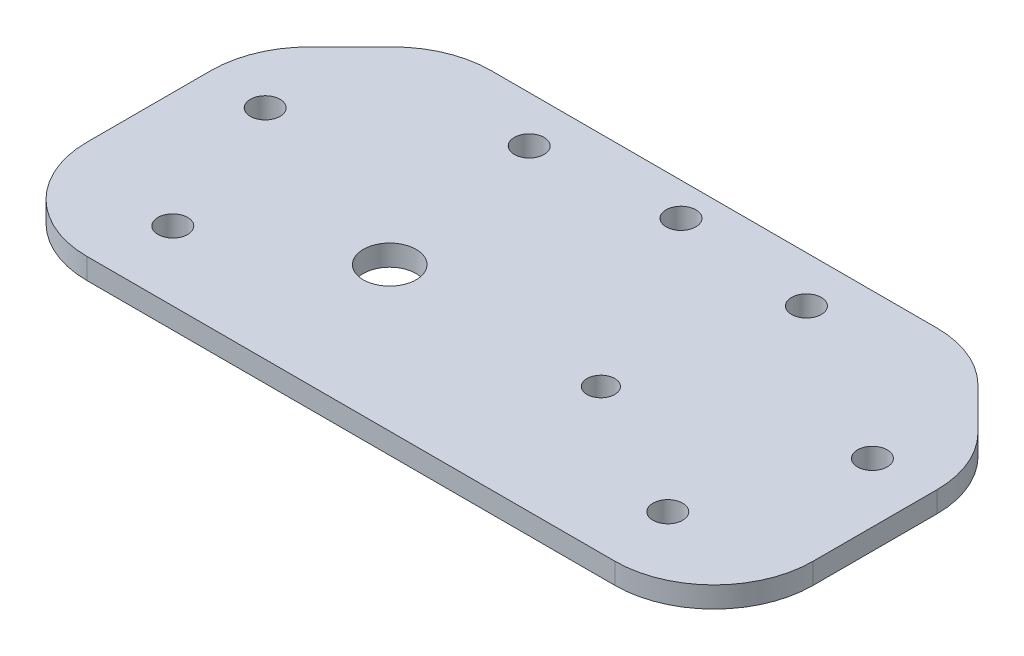
ISO-10303-21;
HEADER;
FILE_DESCRIPTION(('STEP AP214'),'2;1');
FILE_NAME('part.step','',(''),(''),'','','');
FILE_SCHEMA(('AUTOMOTIVE_DESIGN { 1 0 10303 214 1 1 1 1 }'));
ENDSEC;
DATA;
#1=APPLICATION_CONTEXT('core data for automotive mechanical design processes');
#2=APPLICATION_PROTOCOL_DEFINITION('international standard','automotive_design',2000,#1);
#3=PRODUCT_CONTEXT('',#1,'mechanical');
#4=PRODUCT('Part','Part','',(#3));
#5=PRODUCT_RELATED_PRODUCT_CATEGORY('part','',(#4));
#6=PRODUCT_DEFINITION_FORMATION('','',#4);
#7=PRODUCT_DEFINITION_CONTEXT('part definition',#1,'design');
#8=PRODUCT_DEFINITION('design','',#6,#7);
#9=PRODUCT_DEFINITION_SHAPE('','',#8);
#10=(LENGTH_UNIT() NAMED_UNIT(*) SI_UNIT(.MILLI.,.METRE.));
#11=(NAMED_UNIT(*) PLANE_ANGLE_UNIT() SI_UNIT($,.RADIAN.));
#12=(NAMED_UNIT(*) SI_UNIT($,.STERADIAN.) SOLID_ANGLE_UNIT());
#13=UNCERTAINTY_MEASURE_WITH_UNIT(LENGTH_MEASURE(1.E-05),#10,'distance_accuracy_value','');
#14=(GEOMETRIC_REPRESENTATION_CONTEXT(3) GLOBAL_UNCERTAINTY_ASSIGNED_CONTEXT((#13)) GLOBAL_UNIT_ASSIGNED_CONTEXT((#10,
#11,#12)) REPRESENTATION_CONTEXT('',''));
#15=CARTESIAN_POINT('',(0.,0.,0.));
#16=DIRECTION('',(0.,0.,1.));
#17=DIRECTION('',(1.,0.,0.));
#18=AXIS2_PLACEMENT_3D('',#15,#16,#17);
#19=CARTESIAN_POINT('',(-55.,1.5875,27.5));
#20=DIRECTION('',(1.,0.,0.));
#21=DIRECTION('',(0.,0.,-1.));
#22=AXIS2_PLACEMENT_3D('',#19,#20,#21);
#23=PLANE('',#22);
#24=DIRECTION('',(0.,0.,1.));
#25=VECTOR('',#24,1.);
#26=CARTESIAN_POINT('',(-55.,-1.5875,27.5));
#27=LINE('',#26,#25);
#28=CARTESIAN_POINT('',(-55.,-1.5875,-6.28679656440356));
#29=VERTEX_POINT('',#28);
#30=CARTESIAN_POINT('',(-55.,-1.5875,12.5));
#31=VERTEX_POINT('',#30);
#32=EDGE_CURVE('E164',#29,#31,#27,.T.);
#33=ORIENTED_EDGE('',*,*,#32,.T.);
#34=DIRECTION('',(0.,-1.,0.));
#35=VECTOR('',#34,1.);
#36=CARTESIAN_POINT('',(-55.,1.5875,12.5));
#37=LINE('',#36,#35);
#38=CARTESIAN_POINT('',(-55.,1.5875,12.5));
#39=VERTEX_POINT('',#38);
#40=EDGE_CURVE('E142',#31,#39,#37,.F.);
#41=ORIENTED_EDGE('',*,*,#40,.T.);
#42=DIRECTION('',(0.,0.,1.));
#43=VECTOR('',#42,1.);
#44=CARTESIAN_POINT('',(-55.,1.5875,27.5));
#45=LINE('',#44,#43);
#46=CARTESIAN_POINT('',(-55.,1.5875,-6.28679656440356));
#47=VERTEX_POINT('',#46);
#48=EDGE_CURVE('E175',#47,#39,#45,.T.);
#49=ORIENTED_EDGE('',*,*,#48,.F.);
#50=DIRECTION('',(0.,1.,0.));
#51=VECTOR('',#50,1.);
#52=CARTESIAN_POINT('',(-55.,-1.5875,-6.28679656440356));
#53=LINE('',#52,#51);
#54=EDGE_CURVE('E147',#47,#29,#53,.F.);
#55=ORIENTED_EDGE('',*,*,#54,.T.);
#56=EDGE_LOOP('',(#33,#41,#49,#55));
#57=FACE_BOUND('',#56,.T.);
#58=ADVANCED_FACE('F49',(#57),#23,.F.);
#59=CARTESIAN_POINT('',(55.,1.5875,27.5));
#60=DIRECTION('',(0.,0.,-1.));
#61=DIRECTION('',(-1.,0.,0.));
#62=AXIS2_PLACEMENT_3D('',#59,#60,#61);
#63=PLANE('',#62);
#64=DIRECTION('',(1.,0.,0.));
#65=VECTOR('',#64,1.);
#66=CARTESIAN_POINT('',(55.,1.5875,27.5));
#67=LINE('',#66,#65);
#68=CARTESIAN_POINT('',(-40.,1.5875,27.5));
#69=VERTEX_POINT('',#68);
#70=CARTESIAN_POINT('',(40.,1.5875,27.5));
#71=VERTEX_POINT('',#70);
#72=EDGE_CURVE('E157',#69,#71,#67,.T.);
#73=ORIENTED_EDGE('',*,*,#72,.F.);
#74=DIRECTION('',(0.,-1.,0.));
#75=VECTOR('',#74,1.);
#76=CARTESIAN_POINT('',(-40.,1.5875,27.5));
#77=LINE('',#76,#75);
#78=CARTESIAN_POINT('',(-40.,-1.5875,27.5));
#79=VERTEX_POINT('',#78);
#80=EDGE_CURVE('E141',#69,#79,#77,.T.);
#81=ORIENTED_EDGE('',*,*,#80,.T.);
#82=DIRECTION('',(1.,0.,0.));
#83=VECTOR('',#82,1.);
#84=CARTESIAN_POINT('',(55.,-1.5875,27.5));
#85=LINE('',#84,#83);
#86=CARTESIAN_POINT('',(40.,-1.5875,27.5));
#87=VERTEX_POINT('',#86);
#88=EDGE_CURVE('E154',#79,#87,#85,.T.);
#89=ORIENTED_EDGE('',*,*,#88,.T.);
#90=DIRECTION('',(0.,-1.,0.));
#91=VECTOR('',#90,1.);
#92=CARTESIAN_POINT('',(40.,1.5875,27.5));
#93=LINE('',#92,#91);
#94=EDGE_CURVE('E159',#87,#71,#93,.F.);
#95=ORIENTED_EDGE('',*,*,#94,.T.);
#96=EDGE_LOOP('',(#73,#81,#89,#95));
#97=FACE_BOUND('',#96,.T.);
#98=ADVANCED_FACE('F153',(#97),#63,.F.);
#99=CARTESIAN_POINT('',(55.,1.5875,27.5));
#100=DIRECTION('',(-1.,0.,0.));
#101=DIRECTION('',(0.,0.,1.));
#102=AXIS2_PLACEMENT_3D('',#99,#100,#101);
#103=PLANE('',#102);
#104=DIRECTION('',(0.,0.,-1.));
#105=VECTOR('',#104,1.);
#106=CARTESIAN_POINT('',(55.,1.5875,27.5));
#107=LINE('',#106,#105);
#108=CARTESIAN_POINT('',(55.,1.5875,12.5));
#109=VERTEX_POINT('',#108);
#110=CARTESIAN_POINT('',(55.,1.5875,-6.28679656440354));
#111=VERTEX_POINT('',#110);
#112=EDGE_CURVE('E235',#109,#111,#107,.T.);
#113=ORIENTED_EDGE('',*,*,#112,.F.);
#114=DIRECTION('',(0.,-1.,0.));
#115=VECTOR('',#114,1.);
#116=CARTESIAN_POINT('',(55.,1.5875,12.5));
#117=LINE('',#116,#115);
#118=CARTESIAN_POINT('',(55.,-1.5875,12.5));
#119=VERTEX_POINT('',#118);
#120=EDGE_CURVE('E214',#109,#119,#117,.T.);
#121=ORIENTED_EDGE('',*,*,#120,.T.);
#122=DIRECTION('',(0.,0.,-1.));
#123=VECTOR('',#122,1.);
#124=CARTESIAN_POINT('',(55.,-1.5875,27.5));
#125=LINE('',#124,#123);
#126=CARTESIAN_POINT('',(55.,-1.5875,-6.28679656440354));
#127=VERTEX_POINT('',#126);
#128=EDGE_CURVE('E163',#119,#127,#125,.T.);
#129=ORIENTED_EDGE('',*,*,#128,.T.);
#130=DIRECTION('',(0.,-1.,0.));
#131=VECTOR('',#130,1.);
#132=CARTESIAN_POINT('',(55.,1.5875,-6.28679656440354));
#133=LINE('',#132,#131);
#134=EDGE_CURVE('E211',#127,#111,#133,.F.);
#135=ORIENTED_EDGE('',*,*,#134,.T.);
#136=EDGE_LOOP('',(#113,#121,#129,#135));
#137=FACE_BOUND('',#136,.T.);
#138=ADVANCED_FACE('F234',(#137),#103,.F.);
#139=CARTESIAN_POINT('',(55.,1.5875,-27.5));
#140=DIRECTION('',(0.,0.,1.));
#141=DIRECTION('',(1.,0.,0.));
#142=AXIS2_PLACEMENT_3D('',#139,#140,#141);
#143=PLANE('',#142);
#144=DIRECTION('',(-1.,0.,0.));
#145=VECTOR('',#144,1.);
#146=CARTESIAN_POINT('',(55.,-1.5875,-27.5));
#147=LINE('',#146,#145);
#148=CARTESIAN_POINT('',(33.7867965644035,-1.5875,-27.5));
#149=VERTEX_POINT('',#148);
#150=CARTESIAN_POINT('',(-33.7867965644036,-1.5875,-27.5));
#151=VERTEX_POINT('',#150);
#152=EDGE_CURVE('E167',#149,#151,#147,.T.);
#153=ORIENTED_EDGE('',*,*,#152,.T.);
#154=DIRECTION('',(0.,-1.,0.));
#155=VECTOR('',#154,1.);
#156=CARTESIAN_POINT('',(-33.7867965644036,1.5875,-27.5));
#157=LINE('',#156,#155);
#158=CARTESIAN_POINT('',(-33.7867965644036,1.5875,-27.5));
#159=VERTEX_POINT('',#158);
#160=EDGE_CURVE('E224',#151,#159,#157,.F.);
#161=ORIENTED_EDGE('',*,*,#160,.T.);
#162=DIRECTION('',(-1.,0.,0.));
#163=VECTOR('',#162,1.);
#164=CARTESIAN_POINT('',(55.,1.5875,-27.5));
#165=LINE('',#164,#163);
#166=CARTESIAN_POINT('',(33.7867965644035,1.5875,-27.5));
#167=VERTEX_POINT('',#166);
#168=EDGE_CURVE('E180',#167,#159,#165,.T.);
#169=ORIENTED_EDGE('',*,*,#168,.F.);
#170=DIRECTION('',(0.,1.,0.));
#171=VECTOR('',#170,1.);
#172=CARTESIAN_POINT('',(33.7867965644035,-1.5875,-27.5));
#173=LINE('',#172,#171);
#174=EDGE_CURVE('E221',#167,#149,#173,.F.);
#175=ORIENTED_EDGE('',*,*,#174,.T.);
#176=EDGE_LOOP('',(#153,#161,#169,#175));
#177=FACE_BOUND('',#176,.T.);
#178=ADVANCED_FACE('F303',(#177),#143,.F.);
#179=CARTESIAN_POINT('',(0.,1.5875,0.));
#180=DIRECTION('',(0.,1.,0.));
#181=DIRECTION('',(0.,0.,1.));
#182=AXIS2_PLACEMENT_3D('',#179,#180,#181);
#183=PLANE('',#182);
#184=CARTESIAN_POINT('',(16.,1.5875,5.63552872565991));
#185=DIRECTION('',(0.,1.,0.));
#186=DIRECTION('',(0.,0.,1.));
#187=AXIS2_PLACEMENT_3D('',#184,#185,#186);
#188=CIRCLE('',#187,2.1);
#189=CARTESIAN_POINT('',(16.,1.5875,7.73552872565991));
#190=VERTEX_POINT('',#189);
#191=EDGE_CURVE('E295',#190,#190,#188,.T.);
#192=ORIENTED_EDGE('',*,*,#191,.F.);
#193=EDGE_LOOP('',(#192));
#194=FACE_BOUND('',#193,.T.);
#195=CARTESIAN_POINT('',(-16.,1.5875,5.63552872565992));
#196=DIRECTION('',(0.,1.,0.));
#197=DIRECTION('',(0.,0.,1.));
#198=AXIS2_PLACEMENT_3D('',#195,#196,#197);
#199=CIRCLE('',#198,4.00000000000014);
#200=CARTESIAN_POINT('',(-16.,1.5875,9.63552872566006));
#201=VERTEX_POINT('',#200);
#202=EDGE_CURVE('E287',#201,#201,#199,.T.);
#203=ORIENTED_EDGE('',*,*,#202,.F.);
#204=EDGE_LOOP('',(#203));
#205=FACE_BOUND('',#204,.T.);
#206=CARTESIAN_POINT('',(-46.0000000000001,1.5875,-5.50000000000002));
#207=DIRECTION('',(0.,1.,0.));
#208=DIRECTION('',(0.,0.,1.));
#209=AXIS2_PLACEMENT_3D('',#206,#207,#208);
#210=CIRCLE('',#209,2.24999999999999);
#211=CARTESIAN_POINT('',(-46.0000000000001,1.5875,-3.25000000000003));
#212=VERTEX_POINT('',#211);
#213=EDGE_CURVE('E283',#212,#212,#210,.T.);
#214=ORIENTED_EDGE('',*,*,#213,.F.);
#215=EDGE_LOOP('',(#214));
#216=FACE_BOUND('',#215,.T.);
#217=CARTESIAN_POINT('',(46.,1.5875,-5.50000000000002));
#218=DIRECTION('',(0.,1.,0.));
#219=DIRECTION('',(0.,0.,1.));
#220=AXIS2_PLACEMENT_3D('',#217,#218,#219);
#221=CIRCLE('',#220,2.24999999999999);
#222=CARTESIAN_POINT('',(46.,1.5875,-3.25000000000003));
#223=VERTEX_POINT('',#222);
#224=EDGE_CURVE('E277',#223,#223,#221,.T.);
#225=ORIENTED_EDGE('',*,*,#224,.F.);
#226=EDGE_LOOP('',(#225));
#227=FACE_BOUND('',#226,.T.);
#228=CARTESIAN_POINT('',(21.,1.5875,-20.5));
#229=DIRECTION('',(0.,1.,0.));
#230=DIRECTION('',(0.,0.,1.));
#231=AXIS2_PLACEMENT_3D('',#228,#229,#230);
#232=CIRCLE('',#231,2.24999999999999);
#233=CARTESIAN_POINT('',(21.,1.5875,-18.25));
#234=VERTEX_POINT('',#233);
#235=EDGE_CURVE('E271',#234,#234,#232,.T.);
#236=ORIENTED_EDGE('',*,*,#235,.F.);
#237=EDGE_LOOP('',(#236));
#238=FACE_BOUND('',#237,.T.);
#239=CARTESIAN_POINT('',(-20.999999999999,1.5875,-20.5000000000006));
#240=DIRECTION('',(0.,1.,0.));
#241=DIRECTION('',(0.,0.,1.));
#242=AXIS2_PLACEMENT_3D('',#239,#240,#241);
#243=CIRCLE('',#242,2.24999999999999);
#244=CARTESIAN_POINT('',(-20.999999999999,1.5875,-18.2500000000006));
#245=VERTEX_POINT('',#244);
#246=EDGE_CURVE('E265',#245,#245,#243,.T.);
#247=ORIENTED_EDGE('',*,*,#246,.F.);
#248=EDGE_LOOP('',(#247));
#249=FACE_BOUND('',#248,.T.);
#250=CARTESIAN_POINT('',(0.,1.5875,-22.5));
#251=DIRECTION('',(0.,1.,0.));
#252=DIRECTION('',(0.,0.,1.));
#253=AXIS2_PLACEMENT_3D('',#250,#251,#252);
#254=CIRCLE('',#253,2.25);
#255=CARTESIAN_POINT('',(0.,1.5875,-20.25));
#256=VERTEX_POINT('',#255);
#257=EDGE_CURVE('E259',#256,#256,#254,.T.);
#258=ORIENTED_EDGE('',*,*,#257,.F.);
#259=EDGE_LOOP('',(#258));
#260=FACE_BOUND('',#259,.T.);
#261=CARTESIAN_POINT('',(-37.5,1.5875,17.));
#262=DIRECTION('',(0.,1.,0.));
#263=DIRECTION('',(0.,0.,1.));
#264=AXIS2_PLACEMENT_3D('',#261,#262,#263);
#265=CIRCLE('',#264,2.24999999999999);
#266=CARTESIAN_POINT('',(-37.5,1.5875,19.25));
#267=VERTEX_POINT('',#266);
#268=EDGE_CURVE('E253',#267,#267,#265,.T.);
#269=ORIENTED_EDGE('',*,*,#268,.F.);
#270=EDGE_LOOP('',(#269));
#271=FACE_BOUND('',#270,.T.);
#272=CARTESIAN_POINT('',(37.5,1.5875,17.));
#273=DIRECTION('',(0.,1.,0.));
#274=DIRECTION('',(0.,0.,1.));
#275=AXIS2_PLACEMENT_3D('',#272,#273,#274);
#276=CIRCLE('',#275,2.24999999999999);
#277=CARTESIAN_POINT('',(37.5,1.5875,19.25));
#278=VERTEX_POINT('',#277);
#279=EDGE_CURVE('E247',#278,#278,#276,.T.);
#280=ORIENTED_EDGE('',*,*,#279,.F.);
#281=EDGE_LOOP('',(#280));
#282=FACE_BOUND('',#281,.T.);
#283=ORIENTED_EDGE('',*,*,#48,.T.);
#284=CARTESIAN_POINT('',(-40.,1.5875,12.5));
#285=DIRECTION('',(0.,1.,0.));
#286=DIRECTION('',(0.,0.,1.));
#287=AXIS2_PLACEMENT_3D('',#284,#285,#286);
#288=CIRCLE('',#287,15.);
#289=EDGE_CURVE('E209',#39,#69,#288,.T.);
#290=ORIENTED_EDGE('',*,*,#289,.T.);
#291=ORIENTED_EDGE('',*,*,#72,.T.);
#292=CARTESIAN_POINT('',(40.,1.5875,12.5));
#293=DIRECTION('',(0.,1.,0.));
#294=DIRECTION('',(0.,0.,1.));
#295=AXIS2_PLACEMENT_3D('',#292,#293,#294);
#296=CIRCLE('',#295,15.);
#297=EDGE_CURVE('E207',#71,#109,#296,.T.);
#298=ORIENTED_EDGE('',*,*,#297,.T.);
#299=ORIENTED_EDGE('',*,*,#112,.T.);
#300=CARTESIAN_POINT('',(40.,1.5875,-6.28679656440354));
#301=DIRECTION('',(0.,1.,0.));
#302=DIRECTION('',(0.,0.,1.));
#303=AXIS2_PLACEMENT_3D('',#300,#301,#302);
#304=CIRCLE('',#303,15.);
#305=CARTESIAN_POINT('',(50.6066017177982,1.5875,-16.8933982822017));
#306=VERTEX_POINT('',#305);
#307=EDGE_CURVE('E69',#111,#306,#304,.T.);
#308=ORIENTED_EDGE('',*,*,#307,.T.);
#309=DIRECTION('',(0.707106781186546,0.,0.707106781186549));
#310=VECTOR('',#309,1.);
#311=CARTESIAN_POINT('',(33.7500000000001,1.5875,-33.7499999999999));
#312=LINE('',#311,#310);
#313=CARTESIAN_POINT('',(44.3933982822018,1.5875,-23.1066017177982));
#314=VERTEX_POINT('',#313);
#315=EDGE_CURVE('E183',#306,#314,#312,.F.);
#316=ORIENTED_EDGE('',*,*,#315,.T.);
#317=CARTESIAN_POINT('',(33.7867965644035,1.5875,-12.5));
#318=DIRECTION('',(0.,1.,0.));
#319=DIRECTION('',(0.,0.,1.));
#320=AXIS2_PLACEMENT_3D('',#317,#318,#319);
#321=CIRCLE('',#320,15.);
#322=EDGE_CURVE('E201',#314,#167,#321,.T.);
#323=ORIENTED_EDGE('',*,*,#322,.T.);
#324=ORIENTED_EDGE('',*,*,#168,.T.);
#325=CARTESIAN_POINT('',(-33.7867965644036,1.5875,-12.5));
#326=DIRECTION('',(0.,1.,0.));
#327=DIRECTION('',(0.,0.,1.));
#328=AXIS2_PLACEMENT_3D('',#325,#326,#327);
#329=CIRCLE('',#328,15.);
#330=CARTESIAN_POINT('',(-44.3933982822018,1.5875,-23.1066017177982));
#331=VERTEX_POINT('',#330);
#332=EDGE_CURVE('E203',#159,#331,#329,.T.);
#333=ORIENTED_EDGE('',*,*,#332,.T.);
#334=DIRECTION('',(0.707106781186549,0.,-0.707106781186546));
#335=VECTOR('',#334,1.);
#336=CARTESIAN_POINT('',(-33.7499999999999,1.5875,-33.75));
#337=LINE('',#336,#335);
#338=CARTESIAN_POINT('',(-50.6066017177982,1.5875,-16.8933982822018));
#339=VERTEX_POINT('',#338);
#340=EDGE_CURVE('E185',#331,#339,#337,.F.);
#341=ORIENTED_EDGE('',*,*,#340,.T.);
#342=CARTESIAN_POINT('',(-40.,1.5875,-6.28679656440356));
#343=DIRECTION('',(0.,1.,0.));
#344=DIRECTION('',(0.,0.,1.));
#345=AXIS2_PLACEMENT_3D('',#342,#343,#344);
#346=CIRCLE('',#345,15.);
#347=EDGE_CURVE('E205',#339,#47,#346,.T.);
#348=ORIENTED_EDGE('',*,*,#347,.T.);
#349=EDGE_LOOP('',(#283,#290,#291,#298,#299,#308,#316,#323,#324,#333,#341,#348));
#350=FACE_BOUND('',#349,.T.);
#351=ADVANCED_FACE('F238',(#194,#205,#216,#227,#238,#249,#260,#271,#282,#350),#183,.T.);
#352=CARTESIAN_POINT('',(0.,-1.5875,0.));
#353=DIRECTION('',(0.,1.,0.));
#354=DIRECTION('',(0.,0.,1.));
#355=AXIS2_PLACEMENT_3D('',#352,#353,#354);
#356=PLANE('',#355);
#357=CARTESIAN_POINT('',(16.,-1.5875,5.63552872565991));
#358=DIRECTION('',(0.,1.,0.));
#359=DIRECTION('',(0.,0.,1.));
#360=AXIS2_PLACEMENT_3D('',#357,#358,#359);
#361=CIRCLE('',#360,2.1);
#362=CARTESIAN_POINT('',(16.,-1.5875,7.73552872565991));
#363=VERTEX_POINT('',#362);
#364=EDGE_CURVE('E290',#363,#363,#361,.T.);
#365=ORIENTED_EDGE('',*,*,#364,.T.);
#366=EDGE_LOOP('',(#365));
#367=FACE_BOUND('',#366,.T.);
#368=CARTESIAN_POINT('',(-16.,-1.5875,5.63552872565992));
#369=DIRECTION('',(0.,1.,0.));
#370=DIRECTION('',(0.,0.,1.));
#371=AXIS2_PLACEMENT_3D('',#368,#369,#370);
#372=CIRCLE('',#371,4.00000000000014);
#373=CARTESIAN_POINT('',(-16.,-1.5875,9.63552872566006));
#374=VERTEX_POINT('',#373);
#375=EDGE_CURVE('E286',#374,#374,#372,.T.);
#376=ORIENTED_EDGE('',*,*,#375,.T.);
#377=EDGE_LOOP('',(#376));
#378=FACE_BOUND('',#377,.T.);
#379=CARTESIAN_POINT('',(-46.0000000000001,-1.5875,-5.50000000000002));
#380=DIRECTION('',(0.,1.,0.));
#381=DIRECTION('',(0.,0.,1.));
#382=AXIS2_PLACEMENT_3D('',#379,#380,#381);
#383=CIRCLE('',#382,2.25);
#384=CARTESIAN_POINT('',(-46.0000000000001,-1.5875,-3.25000000000001));
#385=VERTEX_POINT('',#384);
#386=EDGE_CURVE('E280',#385,#385,#383,.T.);
#387=ORIENTED_EDGE('',*,*,#386,.T.);
#388=EDGE_LOOP('',(#387));
#389=FACE_BOUND('',#388,.T.);
#390=CARTESIAN_POINT('',(46.,-1.5875,-5.50000000000002));
#391=DIRECTION('',(0.,1.,0.));
#392=DIRECTION('',(0.,0.,1.));
#393=AXIS2_PLACEMENT_3D('',#390,#391,#392);
#394=CIRCLE('',#393,2.25);
#395=CARTESIAN_POINT('',(46.,-1.5875,-3.25000000000001));
#396=VERTEX_POINT('',#395);
#397=EDGE_CURVE('E274',#396,#396,#394,.T.);
#398=ORIENTED_EDGE('',*,*,#397,.T.);
#399=EDGE_LOOP('',(#398));
#400=FACE_BOUND('',#399,.T.);
#401=CARTESIAN_POINT('',(21.,-1.5875,-20.5));
#402=DIRECTION('',(0.,1.,0.));
#403=DIRECTION('',(0.,0.,1.));
#404=AXIS2_PLACEMENT_3D('',#401,#402,#403);
#405=CIRCLE('',#404,2.25);
#406=CARTESIAN_POINT('',(21.,-1.5875,-18.25));
#407=VERTEX_POINT('',#406);
#408=EDGE_CURVE('E268',#407,#407,#405,.T.);
#409=ORIENTED_EDGE('',*,*,#408,.T.);
#410=EDGE_LOOP('',(#409));
#411=FACE_BOUND('',#410,.T.);
#412=CARTESIAN_POINT('',(-20.999999999999,-1.5875,-20.5000000000006));
#413=DIRECTION('',(0.,1.,0.));
#414=DIRECTION('',(0.,0.,1.));
#415=AXIS2_PLACEMENT_3D('',#412,#413,#414);
#416=CIRCLE('',#415,2.25);
#417=CARTESIAN_POINT('',(-20.999999999999,-1.5875,-18.2500000000006));
#418=VERTEX_POINT('',#417);
#419=EDGE_CURVE('E262',#418,#418,#416,.T.);
#420=ORIENTED_EDGE('',*,*,#419,.T.);
#421=EDGE_LOOP('',(#420));
#422=FACE_BOUND('',#421,.T.);
#423=CARTESIAN_POINT('',(0.,-1.5875,-22.5));
#424=DIRECTION('',(0.,1.,0.));
#425=DIRECTION('',(0.,0.,1.));
#426=AXIS2_PLACEMENT_3D('',#423,#424,#425);
#427=CIRCLE('',#426,2.25);
#428=CARTESIAN_POINT('',(0.,-1.5875,-20.25));
#429=VERTEX_POINT('',#428);
#430=EDGE_CURVE('E256',#429,#429,#427,.T.);
#431=ORIENTED_EDGE('',*,*,#430,.T.);
#432=EDGE_LOOP('',(#431));
#433=FACE_BOUND('',#432,.T.);
#434=CARTESIAN_POINT('',(-37.5,-1.5875,17.));
#435=DIRECTION('',(0.,1.,0.));
#436=DIRECTION('',(0.,0.,1.));
#437=AXIS2_PLACEMENT_3D('',#434,#435,#436);
#438=CIRCLE('',#437,2.25);
#439=CARTESIAN_POINT('',(-37.5,-1.5875,19.25));
#440=VERTEX_POINT('',#439);
#441=EDGE_CURVE('E250',#440,#440,#438,.T.);
#442=ORIENTED_EDGE('',*,*,#441,.T.);
#443=EDGE_LOOP('',(#442));
#444=FACE_BOUND('',#443,.T.);
#445=CARTESIAN_POINT('',(37.5,-1.5875,17.));
#446=DIRECTION('',(0.,1.,0.));
#447=DIRECTION('',(0.,0.,1.));
#448=AXIS2_PLACEMENT_3D('',#445,#446,#447);
#449=CIRCLE('',#448,2.25);
#450=CARTESIAN_POINT('',(37.5,-1.5875,19.25));
#451=VERTEX_POINT('',#450);
#452=EDGE_CURVE('E169',#451,#451,#449,.T.);
#453=ORIENTED_EDGE('',*,*,#452,.T.);
#454=EDGE_LOOP('',(#453));
#455=FACE_BOUND('',#454,.T.);
#456=ORIENTED_EDGE('',*,*,#88,.F.);
#457=CARTESIAN_POINT('',(-40.,-1.5875,12.5));
#458=DIRECTION('',(0.,1.,0.));
#459=DIRECTION('',(0.,0.,1.));
#460=AXIS2_PLACEMENT_3D('',#457,#458,#459);
#461=CIRCLE('',#460,15.);
#462=EDGE_CURVE('E137',#79,#31,#461,.F.);
#463=ORIENTED_EDGE('',*,*,#462,.T.);
#464=ORIENTED_EDGE('',*,*,#32,.F.);
#465=CARTESIAN_POINT('',(-40.,-1.5875,-6.28679656440356));
#466=DIRECTION('',(0.,1.,0.));
#467=DIRECTION('',(0.,0.,1.));
#468=AXIS2_PLACEMENT_3D('',#465,#466,#467);
#469=CIRCLE('',#468,15.);
#470=CARTESIAN_POINT('',(-50.6066017177982,-1.5875,-16.8933982822018));
#471=VERTEX_POINT('',#470);
#472=EDGE_CURVE('E194',#29,#471,#469,.F.);
#473=ORIENTED_EDGE('',*,*,#472,.T.);
#474=DIRECTION('',(-0.707106781186549,0.,0.707106781186546));
#475=VECTOR('',#474,1.);
#476=CARTESIAN_POINT('',(-55.,-1.5875,-12.5));
#477=LINE('',#476,#475);
#478=CARTESIAN_POINT('',(-44.3933982822018,-1.5875,-23.1066017177982));
#479=VERTEX_POINT('',#478);
#480=EDGE_CURVE('E179',#471,#479,#477,.F.);
#481=ORIENTED_EDGE('',*,*,#480,.T.);
#482=CARTESIAN_POINT('',(-33.7867965644036,-1.5875,-12.5));
#483=DIRECTION('',(0.,1.,0.));
#484=DIRECTION('',(0.,0.,1.));
#485=AXIS2_PLACEMENT_3D('',#482,#483,#484);
#486=CIRCLE('',#485,15.);
#487=EDGE_CURVE('E192',#479,#151,#486,.F.);
#488=ORIENTED_EDGE('',*,*,#487,.T.);
#489=ORIENTED_EDGE('',*,*,#152,.F.);
#490=CARTESIAN_POINT('',(33.7867965644035,-1.5875,-12.5));
#491=DIRECTION('',(0.,1.,0.));
#492=DIRECTION('',(0.,0.,1.));
#493=AXIS2_PLACEMENT_3D('',#490,#491,#492);
#494=CIRCLE('',#493,15.);
#495=CARTESIAN_POINT('',(44.3933982822018,-1.5875,-23.1066017177982));
#496=VERTEX_POINT('',#495);
#497=EDGE_CURVE('E190',#149,#496,#494,.F.);
#498=ORIENTED_EDGE('',*,*,#497,.T.);
#499=DIRECTION('',(-0.707106781186546,0.,-0.707106781186549));
#500=VECTOR('',#499,1.);
#501=CARTESIAN_POINT('',(40.,-1.5875,-27.5));
#502=LINE('',#501,#500);
#503=CARTESIAN_POINT('',(50.6066017177982,-1.5875,-16.8933982822017));
#504=VERTEX_POINT('',#503);
#505=EDGE_CURVE('E176',#496,#504,#502,.F.);
#506=ORIENTED_EDGE('',*,*,#505,.T.);
#507=CARTESIAN_POINT('',(40.,-1.5875,-6.28679656440354));
#508=DIRECTION('',(0.,1.,0.));
#509=DIRECTION('',(0.,0.,1.));
#510=AXIS2_PLACEMENT_3D('',#507,#508,#509);
#511=CIRCLE('',#510,15.);
#512=EDGE_CURVE('E158',#504,#127,#511,.F.);
#513=ORIENTED_EDGE('',*,*,#512,.T.);
#514=ORIENTED_EDGE('',*,*,#128,.F.);
#515=CARTESIAN_POINT('',(40.,-1.5875,12.5));
#516=DIRECTION('',(0.,1.,0.));
#517=DIRECTION('',(0.,0.,1.));
#518=AXIS2_PLACEMENT_3D('',#515,#516,#517);
#519=CIRCLE('',#518,15.);
#520=EDGE_CURVE('E148',#119,#87,#519,.F.);
#521=ORIENTED_EDGE('',*,*,#520,.T.);
#522=EDGE_LOOP('',(#456,#463,#464,#473,#481,#488,#489,#498,#506,#513,#514,#521));
#523=FACE_BOUND('',#522,.T.);
#524=ADVANCED_FACE('F161',(#367,#378,#389,#400,#411,#422,#433,#444,#455,#523),#356,.F.);
#525=CARTESIAN_POINT('',(37.5,1.5875,17.));
#526=DIRECTION('',(0.,1.,0.));
#527=DIRECTION('',(0.,0.,1.));
#528=AXIS2_PLACEMENT_3D('',#525,#526,#527);
#529=CYLINDRICAL_SURFACE('',#528,2.25);
#530=ORIENTED_EDGE('',*,*,#452,.F.);
#531=EDGE_LOOP('',(#530));
#532=FACE_BOUND('',#531,.T.);
#533=ORIENTED_EDGE('',*,*,#279,.T.);
#534=EDGE_LOOP('',(#533));
#535=FACE_BOUND('',#534,.T.);
#536=ADVANCED_FACE('F321',(#532,#535),#529,.F.);
#537=CARTESIAN_POINT('',(-37.5,1.5875,17.));
#538=DIRECTION('',(0.,1.,0.));
#539=DIRECTION('',(0.,0.,1.));
#540=AXIS2_PLACEMENT_3D('',#537,#538,#539);
#541=CYLINDRICAL_SURFACE('',#540,2.25);
#542=ORIENTED_EDGE('',*,*,#441,.F.);
#543=EDGE_LOOP('',(#542));
#544=FACE_BOUND('',#543,.T.);
#545=ORIENTED_EDGE('',*,*,#268,.T.);
#546=EDGE_LOOP('',(#545));
#547=FACE_BOUND('',#546,.T.);
#548=ADVANCED_FACE('F323',(#544,#547),#541,.F.);
#549=CARTESIAN_POINT('',(0.,1.5875,-22.5));
#550=DIRECTION('',(0.,1.,0.));
#551=DIRECTION('',(0.,0.,1.));
#552=AXIS2_PLACEMENT_3D('',#549,#550,#551);
#553=CYLINDRICAL_SURFACE('',#552,2.25);
#554=ORIENTED_EDGE('',*,*,#257,.T.);
#555=EDGE_LOOP('',(#554));
#556=FACE_BOUND('',#555,.T.);
#557=ORIENTED_EDGE('',*,*,#430,.F.);
#558=EDGE_LOOP('',(#557));
#559=FACE_BOUND('',#558,.T.);
#560=ADVANCED_FACE('F329',(#556,#559),#553,.F.);
#561=CARTESIAN_POINT('',(-20.999999999999,1.5875,-20.5000000000006));
#562=DIRECTION('',(0.,1.,0.));
#563=DIRECTION('',(0.,0.,1.));
#564=AXIS2_PLACEMENT_3D('',#561,#562,#563);
#565=CYLINDRICAL_SURFACE('',#564,2.24999999999999);
#566=ORIENTED_EDGE('',*,*,#419,.F.);
#567=EDGE_LOOP('',(#566));
#568=FACE_BOUND('',#567,.T.);
#569=ORIENTED_EDGE('',*,*,#246,.T.);
#570=EDGE_LOOP('',(#569));
#571=FACE_BOUND('',#570,.T.);
#572=ADVANCED_FACE('F438',(#568,#571),#565,.F.);
#573=CARTESIAN_POINT('',(21.,1.5875,-20.5));
#574=DIRECTION('',(0.,1.,0.));
#575=DIRECTION('',(0.,0.,1.));
#576=AXIS2_PLACEMENT_3D('',#573,#574,#575);
#577=CYLINDRICAL_SURFACE('',#576,2.24999999999999);
#578=ORIENTED_EDGE('',*,*,#408,.F.);
#579=EDGE_LOOP('',(#578));
#580=FACE_BOUND('',#579,.T.);
#581=ORIENTED_EDGE('',*,*,#235,.T.);
#582=EDGE_LOOP('',(#581));
#583=FACE_BOUND('',#582,.T.);
#584=ADVANCED_FACE('F447',(#580,#583),#577,.F.);
#585=CARTESIAN_POINT('',(46.,1.5875,-5.50000000000002));
#586=DIRECTION('',(0.,1.,0.));
#587=DIRECTION('',(0.,0.,1.));
#588=AXIS2_PLACEMENT_3D('',#585,#586,#587);
#589=CYLINDRICAL_SURFACE('',#588,2.25);
#590=ORIENTED_EDGE('',*,*,#397,.F.);
#591=EDGE_LOOP('',(#590));
#592=FACE_BOUND('',#591,.T.);
#593=ORIENTED_EDGE('',*,*,#224,.T.);
#594=EDGE_LOOP('',(#593));
#595=FACE_BOUND('',#594,.T.);
#596=ADVANCED_FACE('F457',(#592,#595),#589,.F.);
#597=CARTESIAN_POINT('',(-46.0000000000001,1.5875,-5.50000000000002));
#598=DIRECTION('',(0.,1.,0.));
#599=DIRECTION('',(0.,0.,1.));
#600=AXIS2_PLACEMENT_3D('',#597,#598,#599);
#601=CYLINDRICAL_SURFACE('',#600,2.25);
#602=ORIENTED_EDGE('',*,*,#386,.F.);
#603=EDGE_LOOP('',(#602));
#604=FACE_BOUND('',#603,.T.);
#605=ORIENTED_EDGE('',*,*,#213,.T.);
#606=EDGE_LOOP('',(#605));
#607=FACE_BOUND('',#606,.T.);
#608=ADVANCED_FACE('F353',(#604,#607),#601,.F.);
#609=CARTESIAN_POINT('',(-55.,1.5875,-12.5));
#610=DIRECTION('',(0.707106781186546,0.,0.707106781186549));
#611=DIRECTION('',(0.,-1.,0.));
#612=AXIS2_PLACEMENT_3D('',#609,#610,#611);
#613=PLANE('',#612);
#614=ORIENTED_EDGE('',*,*,#480,.F.);
#615=DIRECTION('',(0.,-1.,0.));
#616=VECTOR('',#615,1.);
#617=CARTESIAN_POINT('',(-50.6066017177982,1.5875,-16.8933982822018));
#618=LINE('',#617,#616);
#619=EDGE_CURVE('E219',#471,#339,#618,.F.);
#620=ORIENTED_EDGE('',*,*,#619,.T.);
#621=ORIENTED_EDGE('',*,*,#340,.F.);
#622=DIRECTION('',(0.,1.,0.));
#623=VECTOR('',#622,1.);
#624=CARTESIAN_POINT('',(-44.3933982822018,-1.5875,-23.1066017177982));
#625=LINE('',#624,#623);
#626=EDGE_CURVE('E217',#331,#479,#625,.F.);
#627=ORIENTED_EDGE('',*,*,#626,.T.);
#628=EDGE_LOOP('',(#614,#620,#621,#627));
#629=FACE_BOUND('',#628,.T.);
#630=ADVANCED_FACE('F347',(#629),#613,.F.);
#631=CARTESIAN_POINT('',(40.,1.5875,-27.5));
#632=DIRECTION('',(-0.707106781186549,0.,0.707106781186546));
#633=DIRECTION('',(0.,-1.,0.));
#634=AXIS2_PLACEMENT_3D('',#631,#632,#633);
#635=PLANE('',#634);
#636=ORIENTED_EDGE('',*,*,#505,.F.);
#637=DIRECTION('',(0.,-1.,0.));
#638=VECTOR('',#637,1.);
#639=CARTESIAN_POINT('',(44.3933982822018,1.5875,-23.1066017177982));
#640=LINE('',#639,#638);
#641=EDGE_CURVE('E11',#496,#314,#640,.F.);
#642=ORIENTED_EDGE('',*,*,#641,.T.);
#643=ORIENTED_EDGE('',*,*,#315,.F.);
#644=DIRECTION('',(0.,1.,0.));
#645=VECTOR('',#644,1.);
#646=CARTESIAN_POINT('',(50.6066017177982,-1.5875,-16.8933982822017));
#647=LINE('',#646,#645);
#648=EDGE_CURVE('E57',#306,#504,#647,.F.);
#649=ORIENTED_EDGE('',*,*,#648,.T.);
#650=EDGE_LOOP('',(#636,#642,#643,#649));
#651=FACE_BOUND('',#650,.T.);
#652=ADVANCED_FACE('F227',(#651),#635,.F.);
#653=CARTESIAN_POINT('',(-40.,1.5875,12.5));
#654=DIRECTION('',(0.,-1.,0.));
#655=DIRECTION('',(0.,0.,-1.));
#656=AXIS2_PLACEMENT_3D('',#653,#654,#655);
#657=CYLINDRICAL_SURFACE('',#656,15.);
#658=ORIENTED_EDGE('',*,*,#289,.F.);
#659=ORIENTED_EDGE('',*,*,#40,.F.);
#660=ORIENTED_EDGE('',*,*,#462,.F.);
#661=ORIENTED_EDGE('',*,*,#80,.F.);
#662=EDGE_LOOP('',(#658,#659,#660,#661));
#663=FACE_BOUND('',#662,.T.);
#664=ADVANCED_FACE('F140',(#663),#657,.T.);
#665=CARTESIAN_POINT('',(40.,1.5875,12.5));
#666=DIRECTION('',(0.,-1.,0.));
#667=DIRECTION('',(0.,0.,-1.));
#668=AXIS2_PLACEMENT_3D('',#665,#666,#667);
#669=CYLINDRICAL_SURFACE('',#668,15.);
#670=ORIENTED_EDGE('',*,*,#297,.F.);
#671=ORIENTED_EDGE('',*,*,#94,.F.);
#672=ORIENTED_EDGE('',*,*,#520,.F.);
#673=ORIENTED_EDGE('',*,*,#120,.F.);
#674=EDGE_LOOP('',(#670,#671,#672,#673));
#675=FACE_BOUND('',#674,.T.);
#676=ADVANCED_FACE('F361',(#675),#669,.T.);
#677=CARTESIAN_POINT('',(-40.,1.5875,-6.28679656440356));
#678=DIRECTION('',(0.,-1.,0.));
#679=DIRECTION('',(0.,0.,-1.));
#680=AXIS2_PLACEMENT_3D('',#677,#678,#679);
#681=CYLINDRICAL_SURFACE('',#680,15.);
#682=ORIENTED_EDGE('',*,*,#347,.F.);
#683=ORIENTED_EDGE('',*,*,#619,.F.);
#684=ORIENTED_EDGE('',*,*,#472,.F.);
#685=ORIENTED_EDGE('',*,*,#54,.F.);
#686=EDGE_LOOP('',(#682,#683,#684,#685));
#687=FACE_BOUND('',#686,.T.);
#688=ADVANCED_FACE('F364',(#687),#681,.T.);
#689=CARTESIAN_POINT('',(-33.7867965644036,1.5875,-12.5));
#690=DIRECTION('',(0.,1.,0.));
#691=DIRECTION('',(0.,0.,1.));
#692=AXIS2_PLACEMENT_3D('',#689,#690,#691);
#693=CYLINDRICAL_SURFACE('',#692,15.);
#694=ORIENTED_EDGE('',*,*,#487,.F.);
#695=ORIENTED_EDGE('',*,*,#626,.F.);
#696=ORIENTED_EDGE('',*,*,#332,.F.);
#697=ORIENTED_EDGE('',*,*,#160,.F.);
#698=EDGE_LOOP('',(#694,#695,#696,#697));
#699=FACE_BOUND('',#698,.T.);
#700=ADVANCED_FACE('F368',(#699),#693,.T.);
#701=CARTESIAN_POINT('',(33.7867965644035,1.5875,-12.5));
#702=DIRECTION('',(0.,-1.,0.));
#703=DIRECTION('',(0.,0.,-1.));
#704=AXIS2_PLACEMENT_3D('',#701,#702,#703);
#705=CYLINDRICAL_SURFACE('',#704,15.);
#706=ORIENTED_EDGE('',*,*,#322,.F.);
#707=ORIENTED_EDGE('',*,*,#641,.F.);
#708=ORIENTED_EDGE('',*,*,#497,.F.);
#709=ORIENTED_EDGE('',*,*,#174,.F.);
#710=EDGE_LOOP('',(#706,#707,#708,#709));
#711=FACE_BOUND('',#710,.T.);
#712=ADVANCED_FACE('F371',(#711),#705,.T.);
#713=CARTESIAN_POINT('',(40.,1.5875,-6.28679656440354));
#714=DIRECTION('',(0.,1.,0.));
#715=DIRECTION('',(0.,0.,1.));
#716=AXIS2_PLACEMENT_3D('',#713,#714,#715);
#717=CYLINDRICAL_SURFACE('',#716,15.);
#718=ORIENTED_EDGE('',*,*,#512,.F.);
#719=ORIENTED_EDGE('',*,*,#648,.F.);
#720=ORIENTED_EDGE('',*,*,#307,.F.);
#721=ORIENTED_EDGE('',*,*,#134,.F.);
#722=EDGE_LOOP('',(#718,#719,#720,#721));
#723=FACE_BOUND('',#722,.T.);
#724=ADVANCED_FACE('F51',(#723),#717,.T.);
#725=CARTESIAN_POINT('',(-16.,-1.5875,5.63552872565992));
#726=DIRECTION('',(0.,1.,0.));
#727=DIRECTION('',(0.,0.,1.));
#728=AXIS2_PLACEMENT_3D('',#725,#726,#727);
#729=CYLINDRICAL_SURFACE('',#728,4.00000000000014);
#730=ORIENTED_EDGE('',*,*,#375,.F.);
#731=EDGE_LOOP('',(#730));
#732=FACE_BOUND('',#731,.T.);
#733=ORIENTED_EDGE('',*,*,#202,.T.);
#734=EDGE_LOOP('',(#733));
#735=FACE_BOUND('',#734,.T.);
#736=ADVANCED_FACE('F378',(#732,#735),#729,.F.);
#737=CARTESIAN_POINT('',(16.,1.5875,5.63552872565991));
#738=DIRECTION('',(0.,1.,0.));
#739=DIRECTION('',(0.,0.,1.));
#740=AXIS2_PLACEMENT_3D('',#737,#738,#739);
#741=CYLINDRICAL_SURFACE('',#740,2.1);
#742=ORIENTED_EDGE('',*,*,#364,.F.);
#743=EDGE_LOOP('',(#742));
#744=FACE_BOUND('',#743,.T.);
#745=ORIENTED_EDGE('',*,*,#191,.T.);
#746=EDGE_LOOP('',(#745));
#747=FACE_BOUND('',#746,.T.);
#748=ADVANCED_FACE('F299',(#744,#747),#741,.F.);
#749=CLOSED_SHELL('',(#58,#98,#138,#178,#351,#524,#536,#548,#560,#572,#584,#596,#608,#630,#652,
#664,#676,#688,#700,#712,#724,#736,#748));
#750=MANIFOLD_SOLID_BREP('B2',#749);
#751=ADVANCED_BREP_SHAPE_REPRESENTATION('',(#18,#750),#14);
#752=SHAPE_DEFINITION_REPRESENTATION(#9,#751);
ENDSEC;
END-ISO-10303-21;
